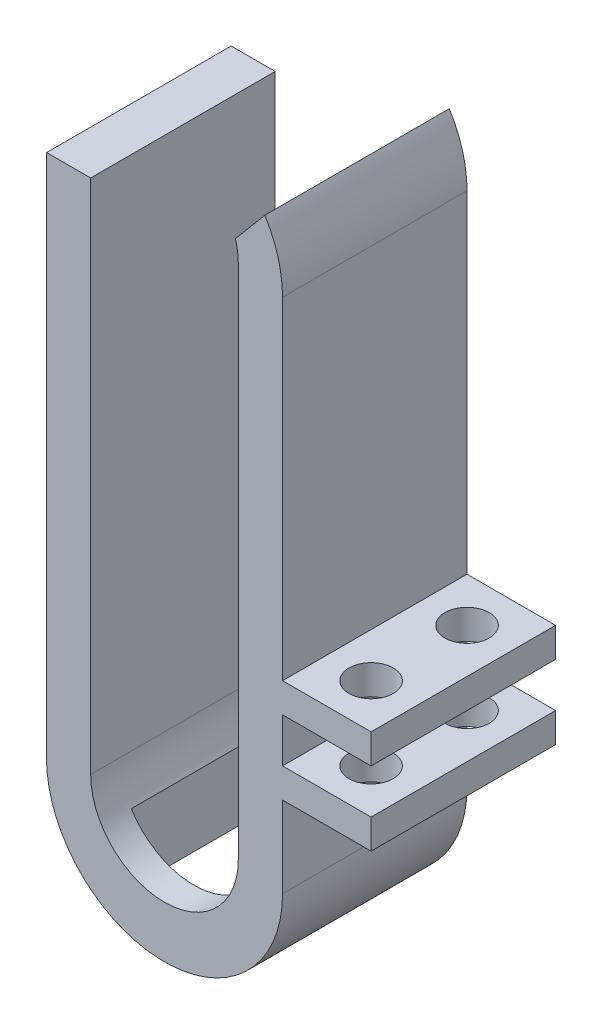
ISO-10303-21;
HEADER;
FILE_DESCRIPTION(('STEP AP214'),'2;1');
FILE_NAME('part.step','',(''),(''),'','','');
FILE_SCHEMA(('AUTOMOTIVE_DESIGN { 1 0 10303 214 1 1 1 1 }'));
ENDSEC;
DATA;
#1=APPLICATION_CONTEXT('core data for automotive mechanical design processes');
#2=APPLICATION_PROTOCOL_DEFINITION('international standard','automotive_design',2000,#1);
#3=PRODUCT_CONTEXT('',#1,'mechanical');
#4=PRODUCT('Part','Part','',(#3));
#5=PRODUCT_RELATED_PRODUCT_CATEGORY('part','',(#4));
#6=PRODUCT_DEFINITION_FORMATION('','',#4);
#7=PRODUCT_DEFINITION_CONTEXT('part definition',#1,'design');
#8=PRODUCT_DEFINITION('design','',#6,#7);
#9=PRODUCT_DEFINITION_SHAPE('','',#8);
#10=(LENGTH_UNIT() NAMED_UNIT(*) SI_UNIT(.MILLI.,.METRE.));
#11=(NAMED_UNIT(*) PLANE_ANGLE_UNIT() SI_UNIT($,.RADIAN.));
#12=(NAMED_UNIT(*) SI_UNIT($,.STERADIAN.) SOLID_ANGLE_UNIT());
#13=UNCERTAINTY_MEASURE_WITH_UNIT(LENGTH_MEASURE(1.E-05),#10,'distance_accuracy_value','');
#14=(GEOMETRIC_REPRESENTATION_CONTEXT(3) GLOBAL_UNCERTAINTY_ASSIGNED_CONTEXT((#13)) GLOBAL_UNIT_ASSIGNED_CONTEXT((#10,
#11,#12)) REPRESENTATION_CONTEXT('',''));
#15=CARTESIAN_POINT('',(0.,0.,0.));
#16=DIRECTION('',(0.,0.,1.));
#17=DIRECTION('',(1.,0.,0.));
#18=AXIS2_PLACEMENT_3D('',#15,#16,#17);
#19=CARTESIAN_POINT('',(7.99999999999995,0.,12.5));
#20=DIRECTION('',(1.,0.,0.));
#21=DIRECTION('',(0.,1.,0.));
#22=AXIS2_PLACEMENT_3D('',#19,#20,#21);
#23=PLANE('',#22);
#24=DIRECTION('',(0.,-1.,0.));
#25=VECTOR('',#24,1.);
#26=CARTESIAN_POINT('',(7.99999999999995,0.,0.));
#27=LINE('',#26,#25);
#28=CARTESIAN_POINT('',(7.99999999999994,-7.5,0.));
#29=VERTEX_POINT('',#28);
#30=CARTESIAN_POINT('',(7.99999999999995,-10.5,0.));
#31=VERTEX_POINT('',#30);
#32=EDGE_CURVE('E278',#29,#31,#27,.T.);
#33=ORIENTED_EDGE('',*,*,#32,.F.);
#34=DIRECTION('',(0.,0.,-1.));
#35=VECTOR('',#34,1.);
#36=CARTESIAN_POINT('',(7.99999999999995,-7.5,12.5));
#37=LINE('',#36,#35);
#38=CARTESIAN_POINT('',(7.99999999999995,-7.5,12.5));
#39=VERTEX_POINT('',#38);
#40=EDGE_CURVE('E347',#39,#29,#37,.T.);
#41=ORIENTED_EDGE('',*,*,#40,.F.);
#42=DIRECTION('',(0.,-1.,0.));
#43=VECTOR('',#42,1.);
#44=CARTESIAN_POINT('',(7.99999999999995,0.,12.5));
#45=LINE('',#44,#43);
#46=CARTESIAN_POINT('',(7.99999999999995,-10.5,12.5));
#47=VERTEX_POINT('',#46);
#48=EDGE_CURVE('E308',#39,#47,#45,.T.);
#49=ORIENTED_EDGE('',*,*,#48,.T.);
#50=DIRECTION('',(0.,0.,1.));
#51=VECTOR('',#50,1.);
#52=CARTESIAN_POINT('',(7.99999999999995,-10.5,12.5));
#53=LINE('',#52,#51);
#54=EDGE_CURVE('E320',#31,#47,#53,.T.);
#55=ORIENTED_EDGE('',*,*,#54,.F.);
#56=EDGE_LOOP('',(#33,#41,#49,#55));
#57=FACE_BOUND('',#56,.T.);
#58=ADVANCED_FACE('F37',(#57),#23,.T.);
#59=CARTESIAN_POINT('',(7.99999999999995,17.,12.5));
#60=VERTEX_POINT('',#59);
#61=CARTESIAN_POINT('',(7.99999999999995,-5.5,12.5));
#62=VERTEX_POINT('',#61);
#63=EDGE_CURVE('E305',#60,#62,#45,.T.);
#64=ORIENTED_EDGE('',*,*,#63,.T.);
#65=DIRECTION('',(0.,0.,1.));
#66=VECTOR('',#65,1.);
#67=CARTESIAN_POINT('',(7.99999999999995,-5.5,12.5));
#68=LINE('',#67,#66);
#69=CARTESIAN_POINT('',(7.99999999999995,-5.5,0.));
#70=VERTEX_POINT('',#69);
#71=EDGE_CURVE('E344',#70,#62,#68,.T.);
#72=ORIENTED_EDGE('',*,*,#71,.F.);
#73=CARTESIAN_POINT('',(7.99999999999995,17.,0.));
#74=VERTEX_POINT('',#73);
#75=EDGE_CURVE('E275',#74,#70,#27,.T.);
#76=ORIENTED_EDGE('',*,*,#75,.F.);
#77=DIRECTION('',(0.,0.,-1.));
#78=VECTOR('',#77,1.);
#79=CARTESIAN_POINT('',(7.99999999999995,17.,12.5));
#80=LINE('',#79,#78);
#81=EDGE_CURVE('E194',#60,#74,#80,.T.);
#82=ORIENTED_EDGE('',*,*,#81,.F.);
#83=EDGE_LOOP('',(#64,#72,#76,#82));
#84=FACE_BOUND('',#83,.T.);
#85=ADVANCED_FACE('F401',(#84),#23,.T.);
#86=CARTESIAN_POINT('',(7.99999999999994,-12.5,0.));
#87=VERTEX_POINT('',#86);
#88=CARTESIAN_POINT('',(7.99999999999994,-18.,0.));
#89=VERTEX_POINT('',#88);
#90=EDGE_CURVE('E279',#87,#89,#27,.T.);
#91=ORIENTED_EDGE('',*,*,#90,.F.);
#92=DIRECTION('',(0.,0.,-1.));
#93=VECTOR('',#92,1.);
#94=CARTESIAN_POINT('',(7.99999999999995,-12.5,12.5));
#95=LINE('',#94,#93);
#96=CARTESIAN_POINT('',(7.99999999999995,-12.5,12.5));
#97=VERTEX_POINT('',#96);
#98=EDGE_CURVE('E324',#97,#87,#95,.T.);
#99=ORIENTED_EDGE('',*,*,#98,.F.);
#100=CARTESIAN_POINT('',(7.99999999999994,-18.,12.5));
#101=VERTEX_POINT('',#100);
#102=EDGE_CURVE('E249',#97,#101,#45,.T.);
#103=ORIENTED_EDGE('',*,*,#102,.T.);
#104=DIRECTION('',(0.,0.,-1.));
#105=VECTOR('',#104,1.);
#106=CARTESIAN_POINT('',(7.99999999999994,-18.,12.5));
#107=LINE('',#106,#105);
#108=EDGE_CURVE('E242',#101,#89,#107,.T.);
#109=ORIENTED_EDGE('',*,*,#108,.T.);
#110=EDGE_LOOP('',(#91,#99,#103,#109));
#111=FACE_BOUND('',#110,.T.);
#112=ADVANCED_FACE('F39',(#111),#23,.T.);
#113=CARTESIAN_POINT('',(0.,17.,12.5));
#114=DIRECTION('',(0.,0.,-1.));
#115=DIRECTION('',(-1.,0.,0.));
#116=AXIS2_PLACEMENT_3D('',#113,#114,#115);
#117=CYLINDRICAL_SURFACE('',#116,7.99999999999998);
#118=CARTESIAN_POINT('',(0.,17.,0.));
#119=DIRECTION('',(0.,0.,1.));
#120=DIRECTION('',(1.,0.,0.));
#121=AXIS2_PLACEMENT_3D('',#118,#119,#120);
#122=CIRCLE('',#121,7.99999999999998);
#123=CARTESIAN_POINT('',(6.80020674968517,21.2139278780653,0.));
#124=VERTEX_POINT('',#123);
#125=EDGE_CURVE('E272',#74,#124,#122,.T.);
#126=ORIENTED_EDGE('',*,*,#125,.T.);
#127=DIRECTION('',(0.,0.,-1.));
#128=VECTOR('',#127,1.);
#129=CARTESIAN_POINT('',(6.80020674968517,21.2139278780653,12.5));
#130=LINE('',#129,#128);
#131=CARTESIAN_POINT('',(6.80020674968517,21.2139278780653,12.5));
#132=VERTEX_POINT('',#131);
#133=EDGE_CURVE('E222',#132,#124,#130,.T.);
#134=ORIENTED_EDGE('',*,*,#133,.F.);
#135=CARTESIAN_POINT('',(0.,17.,12.5));
#136=DIRECTION('',(0.,0.,1.));
#137=DIRECTION('',(1.,0.,0.));
#138=AXIS2_PLACEMENT_3D('',#135,#136,#137);
#139=CIRCLE('',#138,7.99999999999998);
#140=EDGE_CURVE('E303',#60,#132,#139,.T.);
#141=ORIENTED_EDGE('',*,*,#140,.F.);
#142=ORIENTED_EDGE('',*,*,#81,.T.);
#143=EDGE_LOOP('',(#126,#134,#141,#142));
#144=FACE_BOUND('',#143,.T.);
#145=ADVANCED_FACE('F409',(#144),#117,.T.);
#146=CARTESIAN_POINT('',(-6.45529519331706,5.4166358158528,12.5));
#147=DIRECTION('',(-0.766044443118979,0.642787609686539,0.));
#148=DIRECTION('',(-0.642787609686539,-0.766044443118979,0.));
#149=AXIS2_PLACEMENT_3D('',#146,#147,#148);
#150=PLANE('',#149);
#151=DIRECTION('',(0.642787609686539,0.766044443118979,0.));
#152=VECTOR('',#151,1.);
#153=CARTESIAN_POINT('',(-6.45529519331706,5.4166358158528,0.));
#154=LINE('',#153,#152);
#155=CARTESIAN_POINT('',(4.81488589525654,18.8479146173477,0.));
#156=VERTEX_POINT('',#155);
#157=EDGE_CURVE('E269',#156,#124,#154,.T.);
#158=ORIENTED_EDGE('',*,*,#157,.F.);
#159=DIRECTION('',(0.,0.,-1.));
#160=VECTOR('',#159,1.);
#161=CARTESIAN_POINT('',(4.81488589525654,18.8479146173477,12.5));
#162=LINE('',#161,#160);
#163=CARTESIAN_POINT('',(4.81488589525654,18.8479146173477,12.5));
#164=VERTEX_POINT('',#163);
#165=EDGE_CURVE('E224',#164,#156,#162,.T.);
#166=ORIENTED_EDGE('',*,*,#165,.F.);
#167=DIRECTION('',(0.642787609686539,0.766044443118979,0.));
#168=VECTOR('',#167,1.);
#169=CARTESIAN_POINT('',(-6.45529519331706,5.4166358158528,12.5));
#170=LINE('',#169,#168);
#171=EDGE_CURVE('E300',#164,#132,#170,.T.);
#172=ORIENTED_EDGE('',*,*,#171,.T.);
#173=ORIENTED_EDGE('',*,*,#133,.T.);
#174=EDGE_LOOP('',(#158,#166,#172,#173));
#175=FACE_BOUND('',#174,.T.);
#176=ADVANCED_FACE('F414',(#175),#150,.T.);
#177=CARTESIAN_POINT('',(0.,17.5,12.5));
#178=DIRECTION('',(0.,0.,-1.));
#179=DIRECTION('',(-1.,0.,0.));
#180=AXIS2_PLACEMENT_3D('',#177,#178,#179);
#181=CYLINDRICAL_SURFACE('',#180,5.00000000000001);
#182=CARTESIAN_POINT('',(0.,17.5,0.));
#183=DIRECTION('',(0.,0.,1.));
#184=DIRECTION('',(1.,0.,0.));
#185=AXIS2_PLACEMENT_3D('',#182,#183,#184);
#186=CIRCLE('',#185,5.00000000000001);
#187=CARTESIAN_POINT('',(5.00000000000001,17.5,0.));
#188=VERTEX_POINT('',#187);
#189=EDGE_CURVE('E266',#188,#156,#186,.T.);
#190=ORIENTED_EDGE('',*,*,#189,.F.);
#191=DIRECTION('',(0.,0.,-1.));
#192=VECTOR('',#191,1.);
#193=CARTESIAN_POINT('',(5.00000000000001,17.5,12.5));
#194=LINE('',#193,#192);
#195=CARTESIAN_POINT('',(5.00000000000001,17.5,12.5));
#196=VERTEX_POINT('',#195);
#197=EDGE_CURVE('E226',#196,#188,#194,.T.);
#198=ORIENTED_EDGE('',*,*,#197,.F.);
#199=CARTESIAN_POINT('',(0.,17.5,12.5));
#200=DIRECTION('',(0.,0.,1.));
#201=DIRECTION('',(1.,0.,0.));
#202=AXIS2_PLACEMENT_3D('',#199,#200,#201);
#203=CIRCLE('',#202,5.00000000000001);
#204=EDGE_CURVE('E297',#196,#164,#203,.T.);
#205=ORIENTED_EDGE('',*,*,#204,.T.);
#206=ORIENTED_EDGE('',*,*,#165,.T.);
#207=EDGE_LOOP('',(#190,#198,#205,#206));
#208=FACE_BOUND('',#207,.T.);
#209=ADVANCED_FACE('F467',(#208),#181,.F.);
#210=CARTESIAN_POINT('',(5.00000000000001,0.,12.5));
#211=DIRECTION('',(1.,0.,0.));
#212=DIRECTION('',(0.,0.,-1.));
#213=AXIS2_PLACEMENT_3D('',#210,#211,#212);
#214=PLANE('',#213);
#215=DIRECTION('',(0.,-1.,0.));
#216=VECTOR('',#215,1.);
#217=CARTESIAN_POINT('',(5.00000000000001,0.,0.));
#218=LINE('',#217,#216);
#219=CARTESIAN_POINT('',(5.00000000000001,-17.5,0.));
#220=VERTEX_POINT('',#219);
#221=EDGE_CURVE('E263',#188,#220,#218,.T.);
#222=ORIENTED_EDGE('',*,*,#221,.T.);
#223=DIRECTION('',(0.,0.,-1.));
#224=VECTOR('',#223,1.);
#225=CARTESIAN_POINT('',(5.00000000000001,-17.5,12.5));
#226=LINE('',#225,#224);
#227=CARTESIAN_POINT('',(5.00000000000001,-17.5,12.5));
#228=VERTEX_POINT('',#227);
#229=EDGE_CURVE('E228',#228,#220,#226,.T.);
#230=ORIENTED_EDGE('',*,*,#229,.F.);
#231=DIRECTION('',(0.,-1.,0.));
#232=VECTOR('',#231,1.);
#233=CARTESIAN_POINT('',(5.00000000000001,0.,12.5));
#234=LINE('',#233,#232);
#235=EDGE_CURVE('E295',#196,#228,#234,.T.);
#236=ORIENTED_EDGE('',*,*,#235,.F.);
#237=ORIENTED_EDGE('',*,*,#197,.T.);
#238=EDGE_LOOP('',(#222,#230,#236,#237));
#239=FACE_BOUND('',#238,.T.);
#240=ADVANCED_FACE('F464',(#239),#214,.F.);
#241=CARTESIAN_POINT('',(0.,-17.5,12.5));
#242=DIRECTION('',(0.,0.,-1.));
#243=DIRECTION('',(-1.,0.,0.));
#244=AXIS2_PLACEMENT_3D('',#241,#242,#243);
#245=CYLINDRICAL_SURFACE('',#244,5.00000000000001);
#246=DIRECTION('',(0.,0.,-1.));
#247=VECTOR('',#246,1.);
#248=CARTESIAN_POINT('',(-4.25000000000001,-20.1339134382132,12.5));
#249=LINE('',#248,#247);
#250=CARTESIAN_POINT('',(-4.25000000000001,-20.1339134382132,2.));
#251=VERTEX_POINT('',#250);
#252=CARTESIAN_POINT('',(-4.25000000000001,-20.1339134382132,10.5));
#253=VERTEX_POINT('',#252);
#254=EDGE_CURVE('E201',#251,#253,#249,.F.);
#255=ORIENTED_EDGE('',*,*,#254,.F.);
#256=CARTESIAN_POINT('',(0.,-17.5,2.));
#257=DIRECTION('',(0.,0.,-1.));
#258=DIRECTION('',(-1.,0.,0.));
#259=AXIS2_PLACEMENT_3D('',#256,#257,#258);
#260=CIRCLE('',#259,5.00000000000001);
#261=CARTESIAN_POINT('',(4.24999999999999,-20.1339134382132,2.));
#262=VERTEX_POINT('',#261);
#263=EDGE_CURVE('E373',#262,#251,#260,.T.);
#264=ORIENTED_EDGE('',*,*,#263,.F.);
#265=DIRECTION('',(0.,0.,-1.));
#266=VECTOR('',#265,1.);
#267=CARTESIAN_POINT('',(4.25,-20.1339134382132,12.5));
#268=LINE('',#267,#266);
#269=CARTESIAN_POINT('',(4.25,-20.1339134382132,10.5));
#270=VERTEX_POINT('',#269);
#271=EDGE_CURVE('E375',#270,#262,#268,.T.);
#272=ORIENTED_EDGE('',*,*,#271,.F.);
#273=CARTESIAN_POINT('',(0.,-17.5,10.5));
#274=DIRECTION('',(0.,0.,1.));
#275=DIRECTION('',(1.,0.,0.));
#276=AXIS2_PLACEMENT_3D('',#273,#274,#275);
#277=CIRCLE('',#276,5.00000000000001);
#278=EDGE_CURVE('E377',#253,#270,#277,.T.);
#279=ORIENTED_EDGE('',*,*,#278,.F.);
#280=EDGE_LOOP('',(#255,#264,#272,#279));
#281=FACE_BOUND('',#280,.T.);
#282=CARTESIAN_POINT('',(0.,-17.5,0.));
#283=DIRECTION('',(0.,0.,1.));
#284=DIRECTION('',(1.,0.,0.));
#285=AXIS2_PLACEMENT_3D('',#282,#283,#284);
#286=CIRCLE('',#285,5.00000000000001);
#287=CARTESIAN_POINT('',(-5.,-17.5,0.));
#288=VERTEX_POINT('',#287);
#289=EDGE_CURVE('E260',#288,#220,#286,.T.);
#290=ORIENTED_EDGE('',*,*,#289,.F.);
#291=DIRECTION('',(0.,0.,-1.));
#292=VECTOR('',#291,1.);
#293=CARTESIAN_POINT('',(-5.,-17.5,12.5));
#294=LINE('',#293,#292);
#295=CARTESIAN_POINT('',(-5.,-17.5,12.5));
#296=VERTEX_POINT('',#295);
#297=EDGE_CURVE('E230',#296,#288,#294,.T.);
#298=ORIENTED_EDGE('',*,*,#297,.F.);
#299=CARTESIAN_POINT('',(0.,-17.5,12.5));
#300=DIRECTION('',(0.,0.,1.));
#301=DIRECTION('',(1.,0.,0.));
#302=AXIS2_PLACEMENT_3D('',#299,#300,#301);
#303=CIRCLE('',#302,5.00000000000001);
#304=EDGE_CURVE('E292',#296,#228,#303,.T.);
#305=ORIENTED_EDGE('',*,*,#304,.T.);
#306=ORIENTED_EDGE('',*,*,#229,.T.);
#307=EDGE_LOOP('',(#290,#298,#305,#306));
#308=FACE_BOUND('',#307,.T.);
#309=ADVANCED_FACE('F385',(#281,#308),#245,.F.);
#310=CARTESIAN_POINT('',(-5.,0.,12.5));
#311=DIRECTION('',(1.,0.,0.));
#312=DIRECTION('',(0.,1.,0.));
#313=AXIS2_PLACEMENT_3D('',#310,#311,#312);
#314=PLANE('',#313);
#315=DIRECTION('',(0.,-1.,0.));
#316=VECTOR('',#315,1.);
#317=CARTESIAN_POINT('',(-5.,0.,0.));
#318=LINE('',#317,#316);
#319=CARTESIAN_POINT('',(-5.,17.5,0.));
#320=VERTEX_POINT('',#319);
#321=EDGE_CURVE('E257',#320,#288,#318,.T.);
#322=ORIENTED_EDGE('',*,*,#321,.F.);
#323=DIRECTION('',(0.,0.,-1.));
#324=VECTOR('',#323,1.);
#325=CARTESIAN_POINT('',(-5.,17.5,12.5));
#326=LINE('',#325,#324);
#327=CARTESIAN_POINT('',(-5.,17.5,12.5));
#328=VERTEX_POINT('',#327);
#329=EDGE_CURVE('E232',#328,#320,#326,.T.);
#330=ORIENTED_EDGE('',*,*,#329,.F.);
#331=DIRECTION('',(0.,-1.,0.));
#332=VECTOR('',#331,1.);
#333=CARTESIAN_POINT('',(-5.,0.,12.5));
#334=LINE('',#333,#332);
#335=EDGE_CURVE('E289',#328,#296,#334,.T.);
#336=ORIENTED_EDGE('',*,*,#335,.T.);
#337=ORIENTED_EDGE('',*,*,#297,.T.);
#338=EDGE_LOOP('',(#322,#330,#336,#337));
#339=FACE_BOUND('',#338,.T.);
#340=ADVANCED_FACE('F458',(#339),#314,.T.);
#341=CARTESIAN_POINT('',(0.,17.5,12.5));
#342=DIRECTION('',(0.,1.,0.));
#343=DIRECTION('',(0.,0.,1.));
#344=AXIS2_PLACEMENT_3D('',#341,#342,#343);
#345=PLANE('',#344);
#346=DIRECTION('',(1.,0.,0.));
#347=VECTOR('',#346,1.);
#348=CARTESIAN_POINT('',(0.,17.5,0.));
#349=LINE('',#348,#347);
#350=CARTESIAN_POINT('',(-7.98435971133566,17.5,0.));
#351=VERTEX_POINT('',#350);
#352=EDGE_CURVE('E254',#351,#320,#349,.T.);
#353=ORIENTED_EDGE('',*,*,#352,.F.);
#354=DIRECTION('',(0.,0.,-1.));
#355=VECTOR('',#354,1.);
#356=CARTESIAN_POINT('',(-7.98435971133566,17.5,12.5));
#357=LINE('',#356,#355);
#358=CARTESIAN_POINT('',(-7.98435971133566,17.5,12.5));
#359=VERTEX_POINT('',#358);
#360=EDGE_CURVE('E234',#359,#351,#357,.T.);
#361=ORIENTED_EDGE('',*,*,#360,.F.);
#362=DIRECTION('',(1.,0.,0.));
#363=VECTOR('',#362,1.);
#364=CARTESIAN_POINT('',(0.,17.5,12.5));
#365=LINE('',#364,#363);
#366=EDGE_CURVE('E286',#359,#328,#365,.T.);
#367=ORIENTED_EDGE('',*,*,#366,.T.);
#368=ORIENTED_EDGE('',*,*,#329,.T.);
#369=EDGE_LOOP('',(#353,#361,#367,#368));
#370=FACE_BOUND('',#369,.T.);
#371=ADVANCED_FACE('F453',(#370),#345,.T.);
#372=CARTESIAN_POINT('',(0.,17.,12.5));
#373=DIRECTION('',(0.,0.,-1.));
#374=DIRECTION('',(-1.,0.,0.));
#375=AXIS2_PLACEMENT_3D('',#372,#373,#374);
#376=CYLINDRICAL_SURFACE('',#375,7.99999999999998);
#377=CARTESIAN_POINT('',(0.,17.,0.));
#378=DIRECTION('',(0.,0.,1.));
#379=DIRECTION('',(1.,0.,0.));
#380=AXIS2_PLACEMENT_3D('',#377,#378,#379);
#381=CIRCLE('',#380,7.99999999999998);
#382=CARTESIAN_POINT('',(-8.,17.,0.));
#383=VERTEX_POINT('',#382);
#384=EDGE_CURVE('E252',#351,#383,#381,.T.);
#385=ORIENTED_EDGE('',*,*,#384,.T.);
#386=DIRECTION('',(0.,0.,-1.));
#387=VECTOR('',#386,1.);
#388=CARTESIAN_POINT('',(-8.,17.,12.5));
#389=LINE('',#388,#387);
#390=CARTESIAN_POINT('',(-8.,17.,12.5));
#391=VERTEX_POINT('',#390);
#392=EDGE_CURVE('E236',#391,#383,#389,.T.);
#393=ORIENTED_EDGE('',*,*,#392,.F.);
#394=CARTESIAN_POINT('',(0.,17.,12.5));
#395=DIRECTION('',(0.,0.,1.));
#396=DIRECTION('',(1.,0.,0.));
#397=AXIS2_PLACEMENT_3D('',#394,#395,#396);
#398=CIRCLE('',#397,7.99999999999998);
#399=EDGE_CURVE('E284',#359,#391,#398,.T.);
#400=ORIENTED_EDGE('',*,*,#399,.F.);
#401=ORIENTED_EDGE('',*,*,#360,.T.);
#402=EDGE_LOOP('',(#385,#393,#400,#401));
#403=FACE_BOUND('',#402,.T.);
#404=ADVANCED_FACE('F450',(#403),#376,.T.);
#405=CARTESIAN_POINT('',(-8.,0.,12.5));
#406=DIRECTION('',(1.,0.,0.));
#407=DIRECTION('',(0.,1.,0.));
#408=AXIS2_PLACEMENT_3D('',#405,#406,#407);
#409=PLANE('',#408);
#410=DIRECTION('',(0.,-1.,0.));
#411=VECTOR('',#410,1.);
#412=CARTESIAN_POINT('',(-8.,0.,0.));
#413=LINE('',#412,#411);
#414=CARTESIAN_POINT('',(-8.00000000000001,-17.9999996623705,0.));
#415=VERTEX_POINT('',#414);
#416=EDGE_CURVE('E250',#383,#415,#413,.T.);
#417=ORIENTED_EDGE('',*,*,#416,.T.);
#418=DIRECTION('',(0.,0.,-1.));
#419=VECTOR('',#418,1.);
#420=CARTESIAN_POINT('',(-8.00000000000001,-17.9999996623705,12.5));
#421=LINE('',#420,#419);
#422=CARTESIAN_POINT('',(-8.00000000000001,-17.9999996623705,12.5));
#423=VERTEX_POINT('',#422);
#424=EDGE_CURVE('E239',#423,#415,#421,.T.);
#425=ORIENTED_EDGE('',*,*,#424,.F.);
#426=DIRECTION('',(0.,-1.,0.));
#427=VECTOR('',#426,1.);
#428=CARTESIAN_POINT('',(-8.,0.,12.5));
#429=LINE('',#428,#427);
#430=EDGE_CURVE('E282',#391,#423,#429,.T.);
#431=ORIENTED_EDGE('',*,*,#430,.F.);
#432=ORIENTED_EDGE('',*,*,#392,.T.);
#433=EDGE_LOOP('',(#417,#425,#431,#432));
#434=FACE_BOUND('',#433,.T.);
#435=ADVANCED_FACE('F446',(#434),#409,.F.);
#436=CARTESIAN_POINT('',(0.,-17.9999998311853,12.5));
#437=DIRECTION('',(0.,0.,-1.));
#438=DIRECTION('',(-1.,0.,0.));
#439=AXIS2_PLACEMENT_3D('',#436,#437,#438);
#440=CYLINDRICAL_SURFACE('',#439,7.99999999999998);
#441=DIRECTION('',(0.,0.,-1.));
#442=VECTOR('',#441,1.);
#443=CARTESIAN_POINT('',(-4.25000000000001,-24.7777206870482,12.5));
#444=LINE('',#443,#442);
#445=CARTESIAN_POINT('',(-4.25000000000001,-24.7777206870482,2.));
#446=VERTEX_POINT('',#445);
#447=CARTESIAN_POINT('',(-4.25000000000001,-24.7777206870482,10.5));
#448=VERTEX_POINT('',#447);
#449=EDGE_CURVE('E11',#446,#448,#444,.F.);
#450=ORIENTED_EDGE('',*,*,#449,.T.);
#451=CARTESIAN_POINT('',(0.,-17.9999998311853,10.5));
#452=DIRECTION('',(0.,0.,1.));
#453=DIRECTION('',(1.,0.,0.));
#454=AXIS2_PLACEMENT_3D('',#451,#452,#453);
#455=CIRCLE('',#454,7.99999999999998);
#456=CARTESIAN_POINT('',(4.25,-24.7777206870482,10.5));
#457=VERTEX_POINT('',#456);
#458=EDGE_CURVE('E189',#448,#457,#455,.T.);
#459=ORIENTED_EDGE('',*,*,#458,.T.);
#460=DIRECTION('',(0.,0.,-1.));
#461=VECTOR('',#460,1.);
#462=CARTESIAN_POINT('',(4.25,-24.7777206870482,12.5));
#463=LINE('',#462,#461);
#464=CARTESIAN_POINT('',(4.24999999999999,-24.7777206870482,2.));
#465=VERTEX_POINT('',#464);
#466=EDGE_CURVE('E193',#457,#465,#463,.T.);
#467=ORIENTED_EDGE('',*,*,#466,.T.);
#468=CARTESIAN_POINT('',(0.,-17.9999998311853,2.));
#469=DIRECTION('',(0.,0.,-1.));
#470=DIRECTION('',(-1.,0.,0.));
#471=AXIS2_PLACEMENT_3D('',#468,#469,#470);
#472=CIRCLE('',#471,7.99999999999998);
#473=EDGE_CURVE('E45',#465,#446,#472,.T.);
#474=ORIENTED_EDGE('',*,*,#473,.T.);
#475=EDGE_LOOP('',(#450,#459,#467,#474));
#476=FACE_BOUND('',#475,.T.);
#477=CARTESIAN_POINT('',(0.,-17.9999998311853,0.));
#478=DIRECTION('',(0.,0.,1.));
#479=DIRECTION('',(1.,0.,0.));
#480=AXIS2_PLACEMENT_3D('',#477,#478,#479);
#481=CIRCLE('',#480,7.99999999999998);
#482=EDGE_CURVE('E246',#415,#89,#481,.T.);
#483=ORIENTED_EDGE('',*,*,#482,.T.);
#484=ORIENTED_EDGE('',*,*,#108,.F.);
#485=CARTESIAN_POINT('',(0.,-17.9999998311853,12.5));
#486=DIRECTION('',(0.,0.,1.));
#487=DIRECTION('',(1.,0.,0.));
#488=AXIS2_PLACEMENT_3D('',#485,#486,#487);
#489=CIRCLE('',#488,7.99999999999998);
#490=EDGE_CURVE('E245',#423,#101,#489,.T.);
#491=ORIENTED_EDGE('',*,*,#490,.F.);
#492=ORIENTED_EDGE('',*,*,#424,.T.);
#493=EDGE_LOOP('',(#483,#484,#491,#492));
#494=FACE_BOUND('',#493,.T.);
#495=ADVANCED_FACE('F205',(#476,#494),#440,.T.);
#496=CARTESIAN_POINT('',(0.,0.,12.5));
#497=DIRECTION('',(0.,0.,1.));
#498=DIRECTION('',(1.,0.,0.));
#499=AXIS2_PLACEMENT_3D('',#496,#497,#498);
#500=PLANE('',#499);
#501=ORIENTED_EDGE('',*,*,#63,.F.);
#502=ORIENTED_EDGE('',*,*,#140,.T.);
#503=ORIENTED_EDGE('',*,*,#171,.F.);
#504=ORIENTED_EDGE('',*,*,#204,.F.);
#505=ORIENTED_EDGE('',*,*,#235,.T.);
#506=ORIENTED_EDGE('',*,*,#304,.F.);
#507=ORIENTED_EDGE('',*,*,#335,.F.);
#508=ORIENTED_EDGE('',*,*,#366,.F.);
#509=ORIENTED_EDGE('',*,*,#399,.T.);
#510=ORIENTED_EDGE('',*,*,#430,.T.);
#511=ORIENTED_EDGE('',*,*,#490,.T.);
#512=ORIENTED_EDGE('',*,*,#102,.F.);
#513=DIRECTION('',(-1.,0.,0.));
#514=VECTOR('',#513,1.);
#515=CARTESIAN_POINT('',(14.,-12.5,12.5));
#516=LINE('',#515,#514);
#517=CARTESIAN_POINT('',(14.,-12.5,12.5));
#518=VERTEX_POINT('',#517);
#519=EDGE_CURVE('E309',#518,#97,#516,.T.);
#520=ORIENTED_EDGE('',*,*,#519,.F.);
#521=DIRECTION('',(0.,-1.,0.));
#522=VECTOR('',#521,1.);
#523=CARTESIAN_POINT('',(14.,-12.5,12.5));
#524=LINE('',#523,#522);
#525=CARTESIAN_POINT('',(13.9999999999999,-10.5,12.5));
#526=VERTEX_POINT('',#525);
#527=EDGE_CURVE('E323',#526,#518,#524,.T.);
#528=ORIENTED_EDGE('',*,*,#527,.F.);
#529=DIRECTION('',(-1.,0.,0.));
#530=VECTOR('',#529,1.);
#531=CARTESIAN_POINT('',(13.9999999999999,-10.5,12.5));
#532=LINE('',#531,#530);
#533=EDGE_CURVE('E316',#526,#47,#532,.T.);
#534=ORIENTED_EDGE('',*,*,#533,.T.);
#535=ORIENTED_EDGE('',*,*,#48,.F.);
#536=DIRECTION('',(-1.,0.,0.));
#537=VECTOR('',#536,1.);
#538=CARTESIAN_POINT('',(13.9999999999999,-7.5,12.5));
#539=LINE('',#538,#537);
#540=CARTESIAN_POINT('',(13.9999999999999,-7.5,12.5));
#541=VERTEX_POINT('',#540);
#542=EDGE_CURVE('E327',#541,#39,#539,.T.);
#543=ORIENTED_EDGE('',*,*,#542,.F.);
#544=DIRECTION('',(0.,-1.,0.));
#545=VECTOR('',#544,1.);
#546=CARTESIAN_POINT('',(13.9999999999999,-5.5,12.5));
#547=LINE('',#546,#545);
#548=CARTESIAN_POINT('',(13.9999999999999,-5.5,12.5));
#549=VERTEX_POINT('',#548);
#550=EDGE_CURVE('E346',#549,#541,#547,.T.);
#551=ORIENTED_EDGE('',*,*,#550,.F.);
#552=DIRECTION('',(-1.,0.,0.));
#553=VECTOR('',#552,1.);
#554=CARTESIAN_POINT('',(13.9999999999999,-5.5,12.5));
#555=LINE('',#554,#553);
#556=EDGE_CURVE('E340',#549,#62,#555,.T.);
#557=ORIENTED_EDGE('',*,*,#556,.T.);
#558=EDGE_LOOP('',(#501,#502,#503,#504,#505,#506,#507,#508,#509,#510,#511,#512,#520,#528,#534,
#535,#543,#551,#557));
#559=FACE_BOUND('',#558,.T.);
#560=ADVANCED_FACE('F439',(#559),#500,.T.);
#561=CARTESIAN_POINT('',(0.,0.,0.));
#562=DIRECTION('',(0.,0.,1.));
#563=DIRECTION('',(1.,0.,0.));
#564=AXIS2_PLACEMENT_3D('',#561,#562,#563);
#565=PLANE('',#564);
#566=ORIENTED_EDGE('',*,*,#75,.T.);
#567=DIRECTION('',(-1.,0.,0.));
#568=VECTOR('',#567,1.);
#569=CARTESIAN_POINT('',(13.9999999999999,-5.5,0.));
#570=LINE('',#569,#568);
#571=CARTESIAN_POINT('',(13.9999999999999,-5.5,0.));
#572=VERTEX_POINT('',#571);
#573=EDGE_CURVE('E338',#572,#70,#570,.T.);
#574=ORIENTED_EDGE('',*,*,#573,.F.);
#575=DIRECTION('',(0.,1.,0.));
#576=VECTOR('',#575,1.);
#577=CARTESIAN_POINT('',(13.9999999999999,-5.5,0.));
#578=LINE('',#577,#576);
#579=CARTESIAN_POINT('',(13.9999999999999,-7.5,0.));
#580=VERTEX_POINT('',#579);
#581=EDGE_CURVE('E352',#580,#572,#578,.T.);
#582=ORIENTED_EDGE('',*,*,#581,.F.);
#583=DIRECTION('',(-1.,0.,0.));
#584=VECTOR('',#583,1.);
#585=CARTESIAN_POINT('',(13.9999999999999,-7.5,0.));
#586=LINE('',#585,#584);
#587=EDGE_CURVE('E336',#580,#29,#586,.T.);
#588=ORIENTED_EDGE('',*,*,#587,.T.);
#589=ORIENTED_EDGE('',*,*,#32,.T.);
#590=DIRECTION('',(-1.,0.,0.));
#591=VECTOR('',#590,1.);
#592=CARTESIAN_POINT('',(13.9999999999999,-10.5,0.));
#593=LINE('',#592,#591);
#594=CARTESIAN_POINT('',(13.9999999999999,-10.5,0.));
#595=VERTEX_POINT('',#594);
#596=EDGE_CURVE('E313',#595,#31,#593,.T.);
#597=ORIENTED_EDGE('',*,*,#596,.F.);
#598=DIRECTION('',(0.,1.,0.));
#599=VECTOR('',#598,1.);
#600=CARTESIAN_POINT('',(14.,-12.5,0.));
#601=LINE('',#600,#599);
#602=CARTESIAN_POINT('',(14.,-12.5,0.));
#603=VERTEX_POINT('',#602);
#604=EDGE_CURVE('E329',#603,#595,#601,.T.);
#605=ORIENTED_EDGE('',*,*,#604,.F.);
#606=DIRECTION('',(-1.,0.,0.));
#607=VECTOR('',#606,1.);
#608=CARTESIAN_POINT('',(14.,-12.5,0.));
#609=LINE('',#608,#607);
#610=EDGE_CURVE('E311',#603,#87,#609,.T.);
#611=ORIENTED_EDGE('',*,*,#610,.T.);
#612=ORIENTED_EDGE('',*,*,#90,.T.);
#613=ORIENTED_EDGE('',*,*,#482,.F.);
#614=ORIENTED_EDGE('',*,*,#416,.F.);
#615=ORIENTED_EDGE('',*,*,#384,.F.);
#616=ORIENTED_EDGE('',*,*,#352,.T.);
#617=ORIENTED_EDGE('',*,*,#321,.T.);
#618=ORIENTED_EDGE('',*,*,#289,.T.);
#619=ORIENTED_EDGE('',*,*,#221,.F.);
#620=ORIENTED_EDGE('',*,*,#189,.T.);
#621=ORIENTED_EDGE('',*,*,#157,.T.);
#622=ORIENTED_EDGE('',*,*,#125,.F.);
#623=EDGE_LOOP('',(#566,#574,#582,#588,#589,#597,#605,#611,#612,#613,#614,#615,#616,#617,#618,
#619,#620,#621,#622));
#624=FACE_BOUND('',#623,.T.);
#625=ADVANCED_FACE('F423',(#624),#565,.F.);
#626=CARTESIAN_POINT('',(14.,-12.5,12.5));
#627=DIRECTION('',(0.,1.,0.));
#628=DIRECTION('',(-1.,0.,0.));
#629=AXIS2_PLACEMENT_3D('',#626,#627,#628);
#630=PLANE('',#629);
#631=CARTESIAN_POINT('',(10.9999999999999,-12.5,3.));
#632=DIRECTION('',(0.,1.,0.));
#633=DIRECTION('',(-1.,0.,0.));
#634=AXIS2_PLACEMENT_3D('',#631,#632,#633);
#635=CIRCLE('',#634,1.5);
#636=CARTESIAN_POINT('',(9.49999999999994,-12.5,3.));
#637=VERTEX_POINT('',#636);
#638=EDGE_CURVE('E350',#637,#637,#635,.T.);
#639=ORIENTED_EDGE('',*,*,#638,.T.);
#640=EDGE_LOOP('',(#639));
#641=FACE_BOUND('',#640,.T.);
#642=CARTESIAN_POINT('',(10.9999999999999,-12.5,9.5));
#643=DIRECTION('',(0.,1.,0.));
#644=DIRECTION('',(-1.,0.,0.));
#645=AXIS2_PLACEMENT_3D('',#642,#643,#644);
#646=CIRCLE('',#645,1.5);
#647=CARTESIAN_POINT('',(9.49999999999994,-12.5,9.5));
#648=VERTEX_POINT('',#647);
#649=EDGE_CURVE('E216',#648,#648,#646,.T.);
#650=ORIENTED_EDGE('',*,*,#649,.T.);
#651=EDGE_LOOP('',(#650));
#652=FACE_BOUND('',#651,.T.);
#653=ORIENTED_EDGE('',*,*,#98,.T.);
#654=ORIENTED_EDGE('',*,*,#610,.F.);
#655=DIRECTION('',(0.,0.,-1.));
#656=VECTOR('',#655,1.);
#657=CARTESIAN_POINT('',(14.,-12.5,12.5));
#658=LINE('',#657,#656);
#659=EDGE_CURVE('E331',#518,#603,#658,.T.);
#660=ORIENTED_EDGE('',*,*,#659,.F.);
#661=ORIENTED_EDGE('',*,*,#519,.T.);
#662=EDGE_LOOP('',(#653,#654,#660,#661));
#663=FACE_BOUND('',#662,.T.);
#664=ADVANCED_FACE('F504',(#641,#652,#663),#630,.F.);
#665=CARTESIAN_POINT('',(13.9999999999999,-10.5,12.5));
#666=DIRECTION('',(0.,-1.,0.));
#667=DIRECTION('',(1.,0.,0.));
#668=AXIS2_PLACEMENT_3D('',#665,#666,#667);
#669=PLANE('',#668);
#670=CARTESIAN_POINT('',(10.9999999999999,-10.5,3.));
#671=DIRECTION('',(0.,-1.,0.));
#672=DIRECTION('',(1.,0.,0.));
#673=AXIS2_PLACEMENT_3D('',#670,#671,#672);
#674=CIRCLE('',#673,1.5);
#675=CARTESIAN_POINT('',(12.4999999999999,-10.5,3.));
#676=VERTEX_POINT('',#675);
#677=EDGE_CURVE('E360',#676,#676,#674,.T.);
#678=ORIENTED_EDGE('',*,*,#677,.T.);
#679=EDGE_LOOP('',(#678));
#680=FACE_BOUND('',#679,.T.);
#681=CARTESIAN_POINT('',(10.9999999999999,-10.5,9.5));
#682=DIRECTION('',(0.,-1.,0.));
#683=DIRECTION('',(1.,0.,0.));
#684=AXIS2_PLACEMENT_3D('',#681,#682,#683);
#685=CIRCLE('',#684,1.5);
#686=CARTESIAN_POINT('',(12.4999999999999,-10.5,9.5));
#687=VERTEX_POINT('',#686);
#688=EDGE_CURVE('E367',#687,#687,#685,.T.);
#689=ORIENTED_EDGE('',*,*,#688,.T.);
#690=EDGE_LOOP('',(#689));
#691=FACE_BOUND('',#690,.T.);
#692=ORIENTED_EDGE('',*,*,#54,.T.);
#693=ORIENTED_EDGE('',*,*,#533,.F.);
#694=DIRECTION('',(0.,0.,1.));
#695=VECTOR('',#694,1.);
#696=CARTESIAN_POINT('',(13.9999999999999,-10.5,12.5));
#697=LINE('',#696,#695);
#698=EDGE_CURVE('E319',#595,#526,#697,.T.);
#699=ORIENTED_EDGE('',*,*,#698,.F.);
#700=ORIENTED_EDGE('',*,*,#596,.T.);
#701=EDGE_LOOP('',(#692,#693,#699,#700));
#702=FACE_BOUND('',#701,.T.);
#703=ADVANCED_FACE('F431',(#680,#691,#702),#669,.F.);
#704=CARTESIAN_POINT('',(13.9999999999999,0.,0.));
#705=DIRECTION('',(-1.,0.,0.));
#706=DIRECTION('',(0.,-1.,0.));
#707=AXIS2_PLACEMENT_3D('',#704,#705,#706);
#708=PLANE('',#707);
#709=ORIENTED_EDGE('',*,*,#527,.T.);
#710=ORIENTED_EDGE('',*,*,#659,.T.);
#711=ORIENTED_EDGE('',*,*,#604,.T.);
#712=ORIENTED_EDGE('',*,*,#698,.T.);
#713=EDGE_LOOP('',(#709,#710,#711,#712));
#714=FACE_BOUND('',#713,.T.);
#715=ADVANCED_FACE('F488',(#714),#708,.F.);
#716=CARTESIAN_POINT('',(13.9999999999999,-7.5,12.5));
#717=DIRECTION('',(0.,1.,0.));
#718=DIRECTION('',(-1.,0.,0.));
#719=AXIS2_PLACEMENT_3D('',#716,#717,#718);
#720=PLANE('',#719);
#721=CARTESIAN_POINT('',(10.9999999999999,-7.5,3.));
#722=DIRECTION('',(0.,1.,0.));
#723=DIRECTION('',(-1.,0.,0.));
#724=AXIS2_PLACEMENT_3D('',#721,#722,#723);
#725=CIRCLE('',#724,1.5);
#726=CARTESIAN_POINT('',(9.49999999999994,-7.5,3.));
#727=VERTEX_POINT('',#726);
#728=EDGE_CURVE('E215',#727,#727,#725,.T.);
#729=ORIENTED_EDGE('',*,*,#728,.T.);
#730=EDGE_LOOP('',(#729));
#731=FACE_BOUND('',#730,.T.);
#732=CARTESIAN_POINT('',(10.9999999999999,-7.5,9.5));
#733=DIRECTION('',(0.,1.,0.));
#734=DIRECTION('',(-1.,0.,0.));
#735=AXIS2_PLACEMENT_3D('',#732,#733,#734);
#736=CIRCLE('',#735,1.5);
#737=CARTESIAN_POINT('',(9.49999999999994,-7.5,9.5));
#738=VERTEX_POINT('',#737);
#739=EDGE_CURVE('E220',#738,#738,#736,.T.);
#740=ORIENTED_EDGE('',*,*,#739,.T.);
#741=EDGE_LOOP('',(#740));
#742=FACE_BOUND('',#741,.T.);
#743=ORIENTED_EDGE('',*,*,#40,.T.);
#744=ORIENTED_EDGE('',*,*,#587,.F.);
#745=DIRECTION('',(0.,0.,-1.));
#746=VECTOR('',#745,1.);
#747=CARTESIAN_POINT('',(13.9999999999999,-7.5,12.5));
#748=LINE('',#747,#746);
#749=EDGE_CURVE('E354',#541,#580,#748,.T.);
#750=ORIENTED_EDGE('',*,*,#749,.F.);
#751=ORIENTED_EDGE('',*,*,#542,.T.);
#752=EDGE_LOOP('',(#743,#744,#750,#751));
#753=FACE_BOUND('',#752,.T.);
#754=ADVANCED_FACE('F486',(#731,#742,#753),#720,.F.);
#755=CARTESIAN_POINT('',(13.9999999999999,-5.5,12.5));
#756=DIRECTION('',(0.,-1.,0.));
#757=DIRECTION('',(1.,0.,0.));
#758=AXIS2_PLACEMENT_3D('',#755,#756,#757);
#759=PLANE('',#758);
#760=CARTESIAN_POINT('',(10.9999999999999,-5.5,3.));
#761=DIRECTION('',(0.,-1.,0.));
#762=DIRECTION('',(1.,0.,0.));
#763=AXIS2_PLACEMENT_3D('',#760,#761,#762);
#764=CIRCLE('',#763,1.5);
#765=CARTESIAN_POINT('',(12.4999999999999,-5.5,3.));
#766=VERTEX_POINT('',#765);
#767=EDGE_CURVE('E212',#766,#766,#764,.T.);
#768=ORIENTED_EDGE('',*,*,#767,.T.);
#769=EDGE_LOOP('',(#768));
#770=FACE_BOUND('',#769,.T.);
#771=CARTESIAN_POINT('',(10.9999999999999,-5.5,9.5));
#772=DIRECTION('',(0.,-1.,0.));
#773=DIRECTION('',(1.,0.,0.));
#774=AXIS2_PLACEMENT_3D('',#771,#772,#773);
#775=CIRCLE('',#774,1.5);
#776=CARTESIAN_POINT('',(12.4999999999999,-5.5,9.5));
#777=VERTEX_POINT('',#776);
#778=EDGE_CURVE('E217',#777,#777,#775,.T.);
#779=ORIENTED_EDGE('',*,*,#778,.T.);
#780=EDGE_LOOP('',(#779));
#781=FACE_BOUND('',#780,.T.);
#782=ORIENTED_EDGE('',*,*,#71,.T.);
#783=ORIENTED_EDGE('',*,*,#556,.F.);
#784=DIRECTION('',(0.,0.,1.));
#785=VECTOR('',#784,1.);
#786=CARTESIAN_POINT('',(13.9999999999999,-5.5,12.5));
#787=LINE('',#786,#785);
#788=EDGE_CURVE('E343',#572,#549,#787,.T.);
#789=ORIENTED_EDGE('',*,*,#788,.F.);
#790=ORIENTED_EDGE('',*,*,#573,.T.);
#791=EDGE_LOOP('',(#782,#783,#789,#790));
#792=FACE_BOUND('',#791,.T.);
#793=ADVANCED_FACE('F480',(#770,#781,#792),#759,.F.);
#794=CARTESIAN_POINT('',(13.9999999999999,0.,0.));
#795=DIRECTION('',(1.,0.,0.));
#796=DIRECTION('',(0.,0.,-1.));
#797=AXIS2_PLACEMENT_3D('',#794,#795,#796);
#798=PLANE('',#797);
#799=ORIENTED_EDGE('',*,*,#550,.T.);
#800=ORIENTED_EDGE('',*,*,#749,.T.);
#801=ORIENTED_EDGE('',*,*,#581,.T.);
#802=ORIENTED_EDGE('',*,*,#788,.T.);
#803=EDGE_LOOP('',(#799,#800,#801,#802));
#804=FACE_BOUND('',#803,.T.);
#805=ADVANCED_FACE('F484',(#804),#798,.T.);
#806=CARTESIAN_POINT('',(10.9999999999999,-25.9999998311852,9.5));
#807=DIRECTION('',(0.,1.,0.));
#808=DIRECTION('',(-1.,0.,0.));
#809=AXIS2_PLACEMENT_3D('',#806,#807,#808);
#810=CYLINDRICAL_SURFACE('',#809,1.5);
#811=ORIENTED_EDGE('',*,*,#778,.F.);
#812=EDGE_LOOP('',(#811));
#813=FACE_BOUND('',#812,.T.);
#814=ORIENTED_EDGE('',*,*,#739,.F.);
#815=EDGE_LOOP('',(#814));
#816=FACE_BOUND('',#815,.T.);
#817=ADVANCED_FACE('F597',(#813,#816),#810,.F.);
#818=CARTESIAN_POINT('',(10.9999999999999,-25.9999998311852,3.));
#819=DIRECTION('',(0.,1.,0.));
#820=DIRECTION('',(-1.,0.,0.));
#821=AXIS2_PLACEMENT_3D('',#818,#819,#820);
#822=CYLINDRICAL_SURFACE('',#821,1.5);
#823=ORIENTED_EDGE('',*,*,#767,.F.);
#824=EDGE_LOOP('',(#823));
#825=FACE_BOUND('',#824,.T.);
#826=ORIENTED_EDGE('',*,*,#728,.F.);
#827=EDGE_LOOP('',(#826));
#828=FACE_BOUND('',#827,.T.);
#829=ADVANCED_FACE('F609',(#825,#828),#822,.F.);
#830=ORIENTED_EDGE('',*,*,#688,.F.);
#831=EDGE_LOOP('',(#830));
#832=FACE_BOUND('',#831,.T.);
#833=ORIENTED_EDGE('',*,*,#649,.F.);
#834=EDGE_LOOP('',(#833));
#835=FACE_BOUND('',#834,.T.);
#836=ADVANCED_FACE('F612',(#832,#835),#810,.F.);
#837=ORIENTED_EDGE('',*,*,#677,.F.);
#838=EDGE_LOOP('',(#837));
#839=FACE_BOUND('',#838,.T.);
#840=ORIENTED_EDGE('',*,*,#638,.F.);
#841=EDGE_LOOP('',(#840));
#842=FACE_BOUND('',#841,.T.);
#843=ADVANCED_FACE('F398',(#839,#842),#822,.F.);
#844=CARTESIAN_POINT('',(-4.25000000000001,-25.9999998311852,2.));
#845=DIRECTION('',(-1.,0.,0.));
#846=DIRECTION('',(0.,0.,1.));
#847=AXIS2_PLACEMENT_3D('',#844,#845,#846);
#848=PLANE('',#847);
#849=ORIENTED_EDGE('',*,*,#254,.T.);
#850=DIRECTION('',(0.,1.,0.));
#851=VECTOR('',#850,1.);
#852=CARTESIAN_POINT('',(-4.25000000000001,-25.9999998311852,10.5));
#853=LINE('',#852,#851);
#854=EDGE_CURVE('E52',#448,#253,#853,.T.);
#855=ORIENTED_EDGE('',*,*,#854,.F.);
#856=ORIENTED_EDGE('',*,*,#449,.F.);
#857=DIRECTION('',(0.,1.,0.));
#858=VECTOR('',#857,1.);
#859=CARTESIAN_POINT('',(-4.25000000000001,-25.9999998311852,2.));
#860=LINE('',#859,#858);
#861=EDGE_CURVE('E378',#446,#251,#860,.T.);
#862=ORIENTED_EDGE('',*,*,#861,.T.);
#863=EDGE_LOOP('',(#849,#855,#856,#862));
#864=FACE_BOUND('',#863,.T.);
#865=ADVANCED_FACE('F197',(#864),#848,.F.);
#866=CARTESIAN_POINT('',(-4.25000000000001,-25.9999998311852,2.));
#867=DIRECTION('',(0.,0.,-1.));
#868=DIRECTION('',(-1.,0.,0.));
#869=AXIS2_PLACEMENT_3D('',#866,#867,#868);
#870=PLANE('',#869);
#871=ORIENTED_EDGE('',*,*,#263,.T.);
#872=ORIENTED_EDGE('',*,*,#861,.F.);
#873=ORIENTED_EDGE('',*,*,#473,.F.);
#874=DIRECTION('',(0.,1.,0.));
#875=VECTOR('',#874,1.);
#876=CARTESIAN_POINT('',(4.24999999999999,-25.9999998311852,2.));
#877=LINE('',#876,#875);
#878=EDGE_CURVE('E381',#465,#262,#877,.T.);
#879=ORIENTED_EDGE('',*,*,#878,.T.);
#880=EDGE_LOOP('',(#871,#872,#873,#879));
#881=FACE_BOUND('',#880,.T.);
#882=ADVANCED_FACE('F390',(#881),#870,.F.);
#883=CARTESIAN_POINT('',(4.24999999999999,-25.9999998311852,2.));
#884=DIRECTION('',(1.,0.,0.));
#885=DIRECTION('',(0.,0.,-1.));
#886=AXIS2_PLACEMENT_3D('',#883,#884,#885);
#887=PLANE('',#886);
#888=ORIENTED_EDGE('',*,*,#271,.T.);
#889=ORIENTED_EDGE('',*,*,#878,.F.);
#890=ORIENTED_EDGE('',*,*,#466,.F.);
#891=DIRECTION('',(0.,1.,0.));
#892=VECTOR('',#891,1.);
#893=CARTESIAN_POINT('',(4.25,-25.9999998311852,10.5));
#894=LINE('',#893,#892);
#895=EDGE_CURVE('E57',#457,#270,#894,.T.);
#896=ORIENTED_EDGE('',*,*,#895,.T.);
#897=EDGE_LOOP('',(#888,#889,#890,#896));
#898=FACE_BOUND('',#897,.T.);
#899=ADVANCED_FACE('F389',(#898),#887,.F.);
#900=CARTESIAN_POINT('',(-4.25000000000001,-25.9999998311852,10.5));
#901=DIRECTION('',(0.,0.,1.));
#902=DIRECTION('',(1.,0.,0.));
#903=AXIS2_PLACEMENT_3D('',#900,#901,#902);
#904=PLANE('',#903);
#905=ORIENTED_EDGE('',*,*,#278,.T.);
#906=ORIENTED_EDGE('',*,*,#895,.F.);
#907=ORIENTED_EDGE('',*,*,#458,.F.);
#908=ORIENTED_EDGE('',*,*,#854,.T.);
#909=EDGE_LOOP('',(#905,#906,#907,#908));
#910=FACE_BOUND('',#909,.T.);
#911=ADVANCED_FACE('F190',(#910),#904,.F.);
#912=CLOSED_SHELL('',(#58,#85,#112,#145,#176,#209,#240,#309,#340,#371,#404,#435,#495,#560,#625,
#664,#703,#715,#754,#793,#805,#817,#829,#836,#843,#865,#882,#899,#911));
#913=MANIFOLD_SOLID_BREP('B2',#912);
#914=ADVANCED_BREP_SHAPE_REPRESENTATION('',(#18,#913),#14);
#915=SHAPE_DEFINITION_REPRESENTATION(#9,#914);
ENDSEC;
END-ISO-10303-21;
